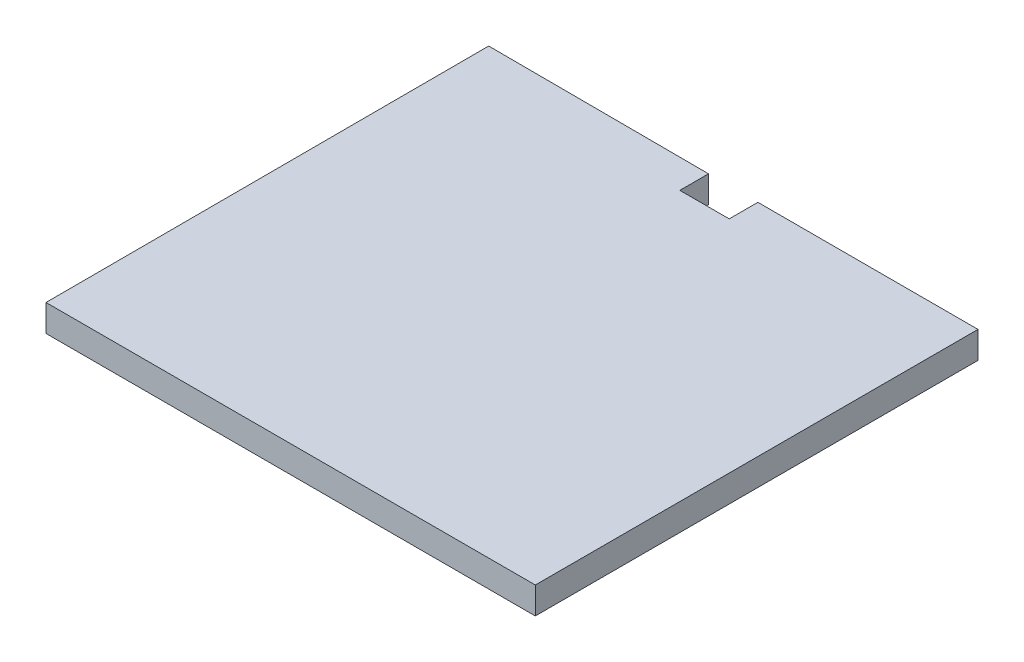
ISO-10303-21;
HEADER;
FILE_DESCRIPTION(('STEP AP214'),'2;1');
FILE_NAME('part.step','',(''),(''),'','','');
FILE_SCHEMA(('AUTOMOTIVE_DESIGN { 1 0 10303 214 1 1 1 1 }'));
ENDSEC;
DATA;
#1=APPLICATION_CONTEXT('core data for automotive mechanical design processes');
#2=APPLICATION_PROTOCOL_DEFINITION('international standard','automotive_design',2000,#1);
#3=PRODUCT_CONTEXT('',#1,'mechanical');
#4=PRODUCT('Part','Part','',(#3));
#5=PRODUCT_RELATED_PRODUCT_CATEGORY('part','',(#4));
#6=PRODUCT_DEFINITION_FORMATION('','',#4);
#7=PRODUCT_DEFINITION_CONTEXT('part definition',#1,'design');
#8=PRODUCT_DEFINITION('design','',#6,#7);
#9=PRODUCT_DEFINITION_SHAPE('','',#8);
#10=(LENGTH_UNIT() NAMED_UNIT(*) SI_UNIT(.MILLI.,.METRE.));
#11=(NAMED_UNIT(*) PLANE_ANGLE_UNIT() SI_UNIT($,.RADIAN.));
#12=(NAMED_UNIT(*) SI_UNIT($,.STERADIAN.) SOLID_ANGLE_UNIT());
#13=UNCERTAINTY_MEASURE_WITH_UNIT(LENGTH_MEASURE(1.E-05),#10,'distance_accuracy_value','');
#14=(GEOMETRIC_REPRESENTATION_CONTEXT(3) GLOBAL_UNCERTAINTY_ASSIGNED_CONTEXT((#13)) GLOBAL_UNIT_ASSIGNED_CONTEXT((#10,
#11,#12)) REPRESENTATION_CONTEXT('',''));
#15=CARTESIAN_POINT('',(0.,0.,0.));
#16=DIRECTION('',(0.,0.,1.));
#17=DIRECTION('',(1.,0.,0.));
#18=AXIS2_PLACEMENT_3D('',#15,#16,#17);
#19=CARTESIAN_POINT('',(10.5047793911352,103.887361751056,6.82610370031045));
#20=DIRECTION('',(0.,0.,1.));
#21=DIRECTION('',(1.,0.,0.));
#22=AXIS2_PLACEMENT_3D('',#19,#20,#21);
#23=PLANE('',#22);
#24=DIRECTION('',(-1.,0.,0.));
#25=VECTOR('',#24,1.);
#26=CARTESIAN_POINT('',(10.5047793911352,92.0763617510564,6.82610370031045));
#27=LINE('',#26,#25);
#28=CARTESIAN_POINT('',(10.5047793911352,92.0763617510564,6.82610370031045));
#29=VERTEX_POINT('',#28);
#30=CARTESIAN_POINT('',(-11.2134283190893,92.0763617510564,6.82610370031045));
#31=VERTEX_POINT('',#30);
#32=EDGE_CURVE('E137',#29,#31,#27,.T.);
#33=ORIENTED_EDGE('',*,*,#32,.T.);
#34=DIRECTION('',(0.,-1.,0.));
#35=VECTOR('',#34,1.);
#36=CARTESIAN_POINT('',(-11.2134283190893,103.887361751056,6.82610370031045));
#37=LINE('',#36,#35);
#38=CARTESIAN_POINT('',(-11.2134283190893,103.887361751056,6.82610370031045));
#39=VERTEX_POINT('',#38);
#40=EDGE_CURVE('E11',#39,#31,#37,.T.);
#41=ORIENTED_EDGE('',*,*,#40,.F.);
#42=DIRECTION('',(-1.,0.,0.));
#43=VECTOR('',#42,1.);
#44=CARTESIAN_POINT('',(10.5047793911352,103.887361751056,6.82610370031045));
#45=LINE('',#44,#43);
#46=CARTESIAN_POINT('',(10.5047793911352,103.887361751056,6.82610370031045));
#47=VERTEX_POINT('',#46);
#48=EDGE_CURVE('E151',#47,#39,#45,.T.);
#49=ORIENTED_EDGE('',*,*,#48,.F.);
#50=DIRECTION('',(0.,-1.,0.));
#51=VECTOR('',#50,1.);
#52=CARTESIAN_POINT('',(10.5047793911352,103.887361751056,6.82610370031045));
#53=LINE('',#52,#51);
#54=EDGE_CURVE('E133',#47,#29,#53,.T.);
#55=ORIENTED_EDGE('',*,*,#54,.T.);
#56=EDGE_LOOP('',(#33,#41,#49,#55));
#57=FACE_BOUND('',#56,.T.);
#58=ADVANCED_FACE('F41',(#57),#23,.F.);
#59=CARTESIAN_POINT('',(-11.2134283190893,103.887361751056,6.82610370031045));
#60=DIRECTION('',(-1.,0.,0.));
#61=DIRECTION('',(0.,0.,1.));
#62=AXIS2_PLACEMENT_3D('',#59,#60,#61);
#63=PLANE('',#62);
#64=DIRECTION('',(0.,0.,-1.));
#65=VECTOR('',#64,1.);
#66=CARTESIAN_POINT('',(-11.2134283190893,92.0763617510564,6.82610370031045));
#67=LINE('',#66,#65);
#68=CARTESIAN_POINT('',(-11.2134283190893,92.0763617510564,-5.78684953739991));
#69=VERTEX_POINT('',#68);
#70=EDGE_CURVE('E140',#31,#69,#67,.T.);
#71=ORIENTED_EDGE('',*,*,#70,.T.);
#72=DIRECTION('',(0.,-1.,0.));
#73=VECTOR('',#72,1.);
#74=CARTESIAN_POINT('',(-11.2134283190893,103.887361751056,-5.78684953739991));
#75=LINE('',#74,#73);
#76=CARTESIAN_POINT('',(-11.2134283190893,103.887361751056,-5.78684953739991));
#77=VERTEX_POINT('',#76);
#78=EDGE_CURVE('E49',#77,#69,#75,.T.);
#79=ORIENTED_EDGE('',*,*,#78,.F.);
#80=DIRECTION('',(0.,0.,-1.));
#81=VECTOR('',#80,1.);
#82=CARTESIAN_POINT('',(-11.2134283190893,103.887361751056,6.82610370031045));
#83=LINE('',#82,#81);
#84=EDGE_CURVE('E100',#39,#77,#83,.T.);
#85=ORIENTED_EDGE('',*,*,#84,.F.);
#86=ORIENTED_EDGE('',*,*,#40,.T.);
#87=EDGE_LOOP('',(#71,#79,#85,#86));
#88=FACE_BOUND('',#87,.T.);
#89=ADVANCED_FACE('F186',(#88),#63,.F.);
#90=CARTESIAN_POINT('',(-11.2134283190893,103.887361751056,-5.78684953739991));
#91=DIRECTION('',(-0.00343672279161728,0.,0.999994094450789));
#92=DIRECTION('',(0.999994094450789,0.,0.00343672279161728));
#93=AXIS2_PLACEMENT_3D('',#90,#91,#92);
#94=PLANE('',#93);
#95=DIRECTION('',(-0.999994094450789,0.,-0.00343672279161728));
#96=VECTOR('',#95,1.);
#97=CARTESIAN_POINT('',(-11.2134283190893,92.0763617510564,-5.78684953739991));
#98=LINE('',#97,#96);
#99=CARTESIAN_POINT('',(-108.204482014186,92.0763617510564,-6.12018287073323));
#100=VERTEX_POINT('',#99);
#101=EDGE_CURVE('E142',#69,#100,#98,.T.);
#102=ORIENTED_EDGE('',*,*,#101,.T.);
#103=DIRECTION('',(0.,-1.,0.));
#104=VECTOR('',#103,1.);
#105=CARTESIAN_POINT('',(-108.204482014186,103.887361751056,-6.12018287073323));
#106=LINE('',#105,#104);
#107=CARTESIAN_POINT('',(-108.204482014186,103.887361751056,-6.12018287073323));
#108=VERTEX_POINT('',#107);
#109=EDGE_CURVE('E158',#108,#100,#106,.T.);
#110=ORIENTED_EDGE('',*,*,#109,.F.);
#111=DIRECTION('',(-0.999994094450789,0.,-0.00343672279161728));
#112=VECTOR('',#111,1.);
#113=CARTESIAN_POINT('',(-11.2134283190893,103.887361751056,-5.78684953739991));
#114=LINE('',#113,#112);
#115=EDGE_CURVE('E166',#77,#108,#114,.T.);
#116=ORIENTED_EDGE('',*,*,#115,.F.);
#117=ORIENTED_EDGE('',*,*,#78,.T.);
#118=EDGE_LOOP('',(#102,#110,#116,#117));
#119=FACE_BOUND('',#118,.T.);
#120=ADVANCED_FACE('F164',(#119),#94,.F.);
#121=CARTESIAN_POINT('',(-108.204482014186,103.887361751056,-6.12018287073323));
#122=DIRECTION('',(0.9999985389761,0.,-0.00170939921192669));
#123=DIRECTION('',(-0.00170939921192669,0.,-0.9999985389761));
#124=AXIS2_PLACEMENT_3D('',#121,#122,#123);
#125=PLANE('',#124);
#126=DIRECTION('',(0.00170939921192669,0.,0.9999985389761));
#127=VECTOR('',#126,1.);
#128=CARTESIAN_POINT('',(-108.204482014186,92.0763617510564,-6.12018287073323));
#129=LINE('',#128,#127);
#130=CARTESIAN_POINT('',(-107.871148680853,92.0763617510564,188.879817129267));
#131=VERTEX_POINT('',#130);
#132=EDGE_CURVE('E144',#100,#131,#129,.T.);
#133=ORIENTED_EDGE('',*,*,#132,.T.);
#134=DIRECTION('',(0.,-1.,0.));
#135=VECTOR('',#134,1.);
#136=CARTESIAN_POINT('',(-107.871148680853,103.887361751056,188.879817129267));
#137=LINE('',#136,#135);
#138=CARTESIAN_POINT('',(-107.871148680853,103.887361751056,188.879817129267));
#139=VERTEX_POINT('',#138);
#140=EDGE_CURVE('E155',#139,#131,#137,.T.);
#141=ORIENTED_EDGE('',*,*,#140,.F.);
#142=DIRECTION('',(0.00170939921192669,0.,0.9999985389761));
#143=VECTOR('',#142,1.);
#144=CARTESIAN_POINT('',(-108.204482014186,103.887361751056,-6.12018287073323));
#145=LINE('',#144,#143);
#146=EDGE_CURVE('E178',#108,#139,#145,.T.);
#147=ORIENTED_EDGE('',*,*,#146,.F.);
#148=ORIENTED_EDGE('',*,*,#109,.T.);
#149=EDGE_LOOP('',(#133,#141,#147,#148));
#150=FACE_BOUND('',#149,.T.);
#151=ADVANCED_FACE('F174',(#150),#125,.F.);
#152=CARTESIAN_POINT('',(-107.871148680853,103.887361751056,188.879817129267));
#153=DIRECTION('',(0.,0.,-1.));
#154=DIRECTION('',(-1.,0.,0.));
#155=AXIS2_PLACEMENT_3D('',#152,#153,#154);
#156=PLANE('',#155);
#157=DIRECTION('',(1.,0.,0.));
#158=VECTOR('',#157,1.);
#159=CARTESIAN_POINT('',(-107.871148680853,92.0763617510564,188.879817129267));
#160=LINE('',#159,#158);
#161=CARTESIAN_POINT('',(107.295517985814,92.0763617510564,188.879817129267));
#162=VERTEX_POINT('',#161);
#163=EDGE_CURVE('E146',#131,#162,#160,.T.);
#164=ORIENTED_EDGE('',*,*,#163,.T.);
#165=DIRECTION('',(0.,-1.,0.));
#166=VECTOR('',#165,1.);
#167=CARTESIAN_POINT('',(107.295517985814,103.887361751056,188.879817129267));
#168=LINE('',#167,#166);
#169=CARTESIAN_POINT('',(107.295517985814,103.887361751056,188.879817129267));
#170=VERTEX_POINT('',#169);
#171=EDGE_CURVE('E128',#170,#162,#168,.T.);
#172=ORIENTED_EDGE('',*,*,#171,.F.);
#173=DIRECTION('',(1.,0.,0.));
#174=VECTOR('',#173,1.);
#175=CARTESIAN_POINT('',(-107.871148680853,103.887361751056,188.879817129267));
#176=LINE('',#175,#174);
#177=EDGE_CURVE('E119',#139,#170,#176,.T.);
#178=ORIENTED_EDGE('',*,*,#177,.F.);
#179=ORIENTED_EDGE('',*,*,#140,.T.);
#180=EDGE_LOOP('',(#164,#172,#178,#179));
#181=FACE_BOUND('',#180,.T.);
#182=ADVANCED_FACE('F177',(#181),#156,.F.);
#183=CARTESIAN_POINT('',(107.295517985814,103.887361751056,188.879817129267));
#184=DIRECTION('',(-1.,0.,0.));
#185=DIRECTION('',(0.,0.,1.));
#186=AXIS2_PLACEMENT_3D('',#183,#184,#185);
#187=PLANE('',#186);
#188=DIRECTION('',(0.,0.,-1.));
#189=VECTOR('',#188,1.);
#190=CARTESIAN_POINT('',(107.295517985814,92.0763617510564,188.879817129267));
#191=LINE('',#190,#189);
#192=CARTESIAN_POINT('',(107.295517985814,92.0763617510564,-5.78684953739991));
#193=VERTEX_POINT('',#192);
#194=EDGE_CURVE('E127',#162,#193,#191,.T.);
#195=ORIENTED_EDGE('',*,*,#194,.T.);
#196=DIRECTION('',(0.,-1.,0.));
#197=VECTOR('',#196,1.);
#198=CARTESIAN_POINT('',(107.295517985814,103.887361751056,-5.78684953739991));
#199=LINE('',#198,#197);
#200=CARTESIAN_POINT('',(107.295517985814,103.887361751056,-5.78684953739991));
#201=VERTEX_POINT('',#200);
#202=EDGE_CURVE('E124',#201,#193,#199,.T.);
#203=ORIENTED_EDGE('',*,*,#202,.F.);
#204=DIRECTION('',(0.,0.,-1.));
#205=VECTOR('',#204,1.);
#206=CARTESIAN_POINT('',(107.295517985814,103.887361751056,188.879817129267));
#207=LINE('',#206,#205);
#208=EDGE_CURVE('E113',#170,#201,#207,.T.);
#209=ORIENTED_EDGE('',*,*,#208,.F.);
#210=ORIENTED_EDGE('',*,*,#171,.T.);
#211=EDGE_LOOP('',(#195,#203,#209,#210));
#212=FACE_BOUND('',#211,.T.);
#213=ADVANCED_FACE('F125',(#212),#187,.F.);
#214=CARTESIAN_POINT('',(107.295517985814,103.887361751056,-5.78684953739991));
#215=DIRECTION('',(0.,0.,1.));
#216=DIRECTION('',(1.,0.,0.));
#217=AXIS2_PLACEMENT_3D('',#214,#215,#216);
#218=PLANE('',#217);
#219=DIRECTION('',(-1.,0.,0.));
#220=VECTOR('',#219,1.);
#221=CARTESIAN_POINT('',(107.295517985814,92.0763617510564,-5.78684953739991));
#222=LINE('',#221,#220);
#223=CARTESIAN_POINT('',(10.5047793911352,92.0763617510564,-5.78684953739991));
#224=VERTEX_POINT('',#223);
#225=EDGE_CURVE('E86',#193,#224,#222,.T.);
#226=ORIENTED_EDGE('',*,*,#225,.T.);
#227=DIRECTION('',(0.,-1.,0.));
#228=VECTOR('',#227,1.);
#229=CARTESIAN_POINT('',(10.5047793911352,103.887361751056,-5.78684953739991));
#230=LINE('',#229,#228);
#231=CARTESIAN_POINT('',(10.5047793911352,103.887361751056,-5.78684953739991));
#232=VERTEX_POINT('',#231);
#233=EDGE_CURVE('E129',#232,#224,#230,.T.);
#234=ORIENTED_EDGE('',*,*,#233,.F.);
#235=DIRECTION('',(-1.,0.,0.));
#236=VECTOR('',#235,1.);
#237=CARTESIAN_POINT('',(107.295517985814,103.887361751056,-5.78684953739991));
#238=LINE('',#237,#236);
#239=EDGE_CURVE('E117',#201,#232,#238,.T.);
#240=ORIENTED_EDGE('',*,*,#239,.F.);
#241=ORIENTED_EDGE('',*,*,#202,.T.);
#242=EDGE_LOOP('',(#226,#234,#240,#241));
#243=FACE_BOUND('',#242,.T.);
#244=ADVANCED_FACE('F131',(#243),#218,.F.);
#245=CARTESIAN_POINT('',(10.5047793911352,103.887361751056,-5.78684953739991));
#246=DIRECTION('',(1.,0.,0.));
#247=DIRECTION('',(0.,0.,-1.));
#248=AXIS2_PLACEMENT_3D('',#245,#246,#247);
#249=PLANE('',#248);
#250=DIRECTION('',(0.,0.,1.));
#251=VECTOR('',#250,1.);
#252=CARTESIAN_POINT('',(10.5047793911352,92.0763617510564,-5.78684953739991));
#253=LINE('',#252,#251);
#254=EDGE_CURVE('E92',#224,#29,#253,.T.);
#255=ORIENTED_EDGE('',*,*,#254,.T.);
#256=ORIENTED_EDGE('',*,*,#54,.F.);
#257=DIRECTION('',(0.,0.,1.));
#258=VECTOR('',#257,1.);
#259=CARTESIAN_POINT('',(10.5047793911352,103.887361751056,-5.78684953739991));
#260=LINE('',#259,#258);
#261=EDGE_CURVE('E57',#232,#47,#260,.T.);
#262=ORIENTED_EDGE('',*,*,#261,.F.);
#263=ORIENTED_EDGE('',*,*,#233,.T.);
#264=EDGE_LOOP('',(#255,#256,#262,#263));
#265=FACE_BOUND('',#264,.T.);
#266=ADVANCED_FACE('F202',(#265),#249,.F.);
#267=CARTESIAN_POINT('',(0.,103.887361751056,0.));
#268=DIRECTION('',(0.,-1.,0.));
#269=DIRECTION('',(0.,0.,-1.));
#270=AXIS2_PLACEMENT_3D('',#267,#268,#269);
#271=PLANE('',#270);
#272=ORIENTED_EDGE('',*,*,#48,.T.);
#273=ORIENTED_EDGE('',*,*,#84,.T.);
#274=ORIENTED_EDGE('',*,*,#115,.T.);
#275=ORIENTED_EDGE('',*,*,#146,.T.);
#276=ORIENTED_EDGE('',*,*,#177,.T.);
#277=ORIENTED_EDGE('',*,*,#208,.T.);
#278=ORIENTED_EDGE('',*,*,#239,.T.);
#279=ORIENTED_EDGE('',*,*,#261,.T.);
#280=EDGE_LOOP('',(#272,#273,#274,#275,#276,#277,#278,#279));
#281=FACE_BOUND('',#280,.T.);
#282=ADVANCED_FACE('F115',(#281),#271,.F.);
#283=CARTESIAN_POINT('',(0.,92.0763617510564,0.));
#284=DIRECTION('',(0.,-1.,0.));
#285=DIRECTION('',(0.,0.,-1.));
#286=AXIS2_PLACEMENT_3D('',#283,#284,#285);
#287=PLANE('',#286);
#288=ORIENTED_EDGE('',*,*,#32,.F.);
#289=ORIENTED_EDGE('',*,*,#254,.F.);
#290=ORIENTED_EDGE('',*,*,#225,.F.);
#291=ORIENTED_EDGE('',*,*,#194,.F.);
#292=ORIENTED_EDGE('',*,*,#163,.F.);
#293=ORIENTED_EDGE('',*,*,#132,.F.);
#294=ORIENTED_EDGE('',*,*,#101,.F.);
#295=ORIENTED_EDGE('',*,*,#70,.F.);
#296=EDGE_LOOP('',(#288,#289,#290,#291,#292,#293,#294,#295));
#297=FACE_BOUND('',#296,.T.);
#298=ADVANCED_FACE('F170',(#297),#287,.T.);
#299=CLOSED_SHELL('',(#58,#89,#120,#151,#182,#213,#244,#266,#282,#298));
#300=MANIFOLD_SOLID_BREP('B2',#299);
#301=ADVANCED_BREP_SHAPE_REPRESENTATION('',(#18,#300),#14);
#302=SHAPE_DEFINITION_REPRESENTATION(#9,#301);
ENDSEC;
END-ISO-10303-21;
